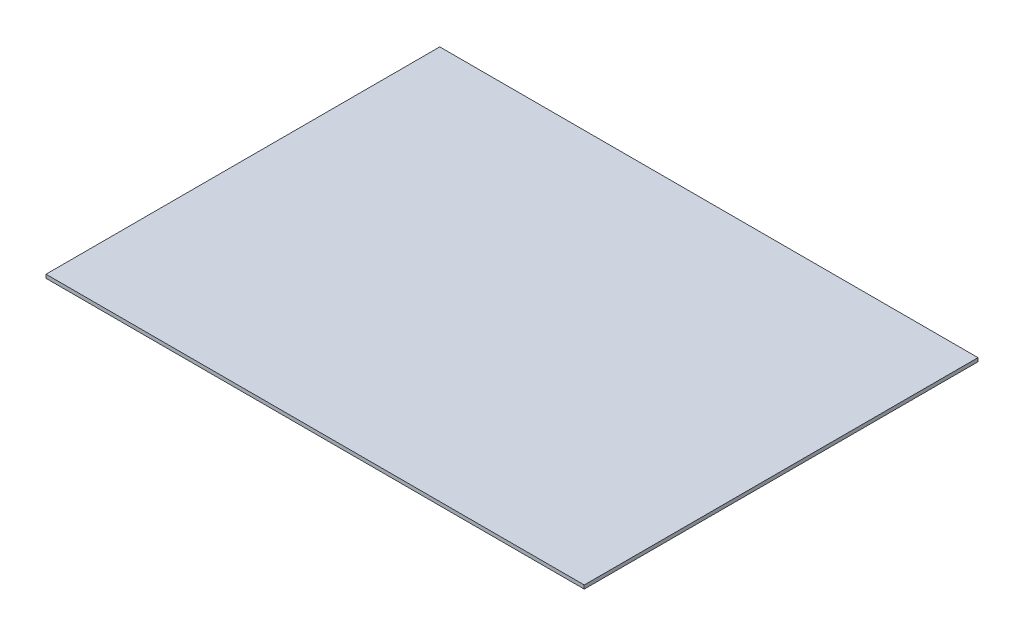
ISO-10303-21;
HEADER;
FILE_DESCRIPTION(('STEP AP214'),'2;1');
FILE_NAME('part.step','',(''),(''),'','','');
FILE_SCHEMA(('AUTOMOTIVE_DESIGN { 1 0 10303 214 1 1 1 1 }'));
ENDSEC;
DATA;
#1=APPLICATION_CONTEXT('core data for automotive mechanical design processes');
#2=APPLICATION_PROTOCOL_DEFINITION('international standard','automotive_design',2000,#1);
#3=PRODUCT_CONTEXT('',#1,'mechanical');
#4=PRODUCT('Part','Part','',(#3));
#5=PRODUCT_RELATED_PRODUCT_CATEGORY('part','',(#4));
#6=PRODUCT_DEFINITION_FORMATION('','',#4);
#7=PRODUCT_DEFINITION_CONTEXT('part definition',#1,'design');
#8=PRODUCT_DEFINITION('design','',#6,#7);
#9=PRODUCT_DEFINITION_SHAPE('','',#8);
#10=(LENGTH_UNIT() NAMED_UNIT(*) SI_UNIT(.MILLI.,.METRE.));
#11=(NAMED_UNIT(*) PLANE_ANGLE_UNIT() SI_UNIT($,.RADIAN.));
#12=(NAMED_UNIT(*) SI_UNIT($,.STERADIAN.) SOLID_ANGLE_UNIT());
#13=UNCERTAINTY_MEASURE_WITH_UNIT(LENGTH_MEASURE(1.E-05),#10,'distance_accuracy_value','');
#14=(GEOMETRIC_REPRESENTATION_CONTEXT(3) GLOBAL_UNCERTAINTY_ASSIGNED_CONTEXT((#13)) GLOBAL_UNIT_ASSIGNED_CONTEXT((#10,
#11,#12)) REPRESENTATION_CONTEXT('',''));
#15=CARTESIAN_POINT('',(0.,0.,0.));
#16=DIRECTION('',(0.,0.,1.));
#17=DIRECTION('',(1.,0.,0.));
#18=AXIS2_PLACEMENT_3D('',#15,#16,#17);
#19=CARTESIAN_POINT('',(298.,0.,-191.321685100182));
#20=DIRECTION('',(0.,0.,1.));
#21=DIRECTION('',(1.,0.,0.));
#22=AXIS2_PLACEMENT_3D('',#19,#20,#21);
#23=PLANE('',#22);
#24=DIRECTION('',(0.,1.,0.));
#25=VECTOR('',#24,1.);
#26=CARTESIAN_POINT('',(0.,0.,-191.321685100182));
#27=LINE('',#26,#25);
#28=CARTESIAN_POINT('',(0.,0.,-191.321685100182));
#29=VERTEX_POINT('',#28);
#30=CARTESIAN_POINT('',(0.,2.,-191.321685100182));
#31=VERTEX_POINT('',#30);
#32=EDGE_CURVE('E112',#29,#31,#27,.T.);
#33=ORIENTED_EDGE('',*,*,#32,.T.);
#34=DIRECTION('',(-1.,0.,0.));
#35=VECTOR('',#34,1.);
#36=CARTESIAN_POINT('',(298.,2.,-191.321685100182));
#37=LINE('',#36,#35);
#38=CARTESIAN_POINT('',(298.,2.,-191.321685100182));
#39=VERTEX_POINT('',#38);
#40=EDGE_CURVE('E11',#39,#31,#37,.T.);
#41=ORIENTED_EDGE('',*,*,#40,.F.);
#42=DIRECTION('',(0.,1.,0.));
#43=VECTOR('',#42,1.);
#44=CARTESIAN_POINT('',(298.,0.,-191.321685100182));
#45=LINE('',#44,#43);
#46=CARTESIAN_POINT('',(298.,0.,-191.321685100182));
#47=VERTEX_POINT('',#46);
#48=EDGE_CURVE('E93',#47,#39,#45,.T.);
#49=ORIENTED_EDGE('',*,*,#48,.F.);
#50=DIRECTION('',(-1.,0.,0.));
#51=VECTOR('',#50,1.);
#52=CARTESIAN_POINT('',(298.,0.,-191.321685100182));
#53=LINE('',#52,#51);
#54=EDGE_CURVE('E108',#47,#29,#53,.T.);
#55=ORIENTED_EDGE('',*,*,#54,.T.);
#56=EDGE_LOOP('',(#33,#41,#49,#55));
#57=FACE_BOUND('',#56,.T.);
#58=ADVANCED_FACE('F45',(#57),#23,.F.);
#59=CARTESIAN_POINT('',(298.,2.,-191.321685100182));
#60=DIRECTION('',(0.,-1.,0.));
#61=DIRECTION('',(0.,0.,-1.));
#62=AXIS2_PLACEMENT_3D('',#59,#60,#61);
#63=PLANE('',#62);
#64=DIRECTION('',(0.,0.,1.));
#65=VECTOR('',#64,1.);
#66=CARTESIAN_POINT('',(0.,2.,-191.321685100182));
#67=LINE('',#66,#65);
#68=CARTESIAN_POINT('',(0.,2.,26.6783148998178));
#69=VERTEX_POINT('',#68);
#70=EDGE_CURVE('E99',#31,#69,#67,.T.);
#71=ORIENTED_EDGE('',*,*,#70,.T.);
#72=DIRECTION('',(-1.,0.,0.));
#73=VECTOR('',#72,1.);
#74=CARTESIAN_POINT('',(298.,2.,26.6783148998178));
#75=LINE('',#74,#73);
#76=CARTESIAN_POINT('',(298.,2.,26.6783148998178));
#77=VERTEX_POINT('',#76);
#78=EDGE_CURVE('E54',#77,#69,#75,.T.);
#79=ORIENTED_EDGE('',*,*,#78,.F.);
#80=DIRECTION('',(0.,0.,1.));
#81=VECTOR('',#80,1.);
#82=CARTESIAN_POINT('',(298.,2.,-191.321685100182));
#83=LINE('',#82,#81);
#84=EDGE_CURVE('E88',#39,#77,#83,.T.);
#85=ORIENTED_EDGE('',*,*,#84,.F.);
#86=ORIENTED_EDGE('',*,*,#40,.T.);
#87=EDGE_LOOP('',(#71,#79,#85,#86));
#88=FACE_BOUND('',#87,.T.);
#89=ADVANCED_FACE('F98',(#88),#63,.F.);
#90=CARTESIAN_POINT('',(298.,0.,26.6783148998178));
#91=DIRECTION('',(0.,0.,1.));
#92=DIRECTION('',(1.,0.,0.));
#93=AXIS2_PLACEMENT_3D('',#90,#91,#92);
#94=PLANE('',#93);
#95=DIRECTION('',(0.,1.,0.));
#96=VECTOR('',#95,1.);
#97=CARTESIAN_POINT('',(0.,0.,26.6783148998178));
#98=LINE('',#97,#96);
#99=CARTESIAN_POINT('',(0.,0.,26.6783148998178));
#100=VERTEX_POINT('',#99);
#101=EDGE_CURVE('E118',#100,#69,#98,.T.);
#102=ORIENTED_EDGE('',*,*,#101,.F.);
#103=DIRECTION('',(-1.,0.,0.));
#104=VECTOR('',#103,1.);
#105=CARTESIAN_POINT('',(298.,0.,26.6783148998178));
#106=LINE('',#105,#104);
#107=CARTESIAN_POINT('',(298.,0.,26.6783148998178));
#108=VERTEX_POINT('',#107);
#109=EDGE_CURVE('E78',#108,#100,#106,.T.);
#110=ORIENTED_EDGE('',*,*,#109,.F.);
#111=DIRECTION('',(0.,1.,0.));
#112=VECTOR('',#111,1.);
#113=CARTESIAN_POINT('',(298.,0.,26.6783148998178));
#114=LINE('',#113,#112);
#115=EDGE_CURVE('E91',#108,#77,#114,.T.);
#116=ORIENTED_EDGE('',*,*,#115,.T.);
#117=ORIENTED_EDGE('',*,*,#78,.T.);
#118=EDGE_LOOP('',(#102,#110,#116,#117));
#119=FACE_BOUND('',#118,.T.);
#120=ADVANCED_FACE('F104',(#119),#94,.T.);
#121=CARTESIAN_POINT('',(298.,0.,26.6783148998178));
#122=DIRECTION('',(0.,1.,0.));
#123=DIRECTION('',(0.,0.,1.));
#124=AXIS2_PLACEMENT_3D('',#121,#122,#123);
#125=PLANE('',#124);
#126=DIRECTION('',(0.,0.,-1.));
#127=VECTOR('',#126,1.);
#128=CARTESIAN_POINT('',(0.,0.,26.6783148998178));
#129=LINE('',#128,#127);
#130=EDGE_CURVE('E81',#100,#29,#129,.T.);
#131=ORIENTED_EDGE('',*,*,#130,.T.);
#132=ORIENTED_EDGE('',*,*,#54,.F.);
#133=DIRECTION('',(0.,0.,-1.));
#134=VECTOR('',#133,1.);
#135=CARTESIAN_POINT('',(298.,0.,26.6783148998178));
#136=LINE('',#135,#134);
#137=EDGE_CURVE('E62',#108,#47,#136,.T.);
#138=ORIENTED_EDGE('',*,*,#137,.F.);
#139=ORIENTED_EDGE('',*,*,#109,.T.);
#140=EDGE_LOOP('',(#131,#132,#138,#139));
#141=FACE_BOUND('',#140,.T.);
#142=ADVANCED_FACE('F135',(#141),#125,.F.);
#143=CARTESIAN_POINT('',(298.,0.,0.));
#144=DIRECTION('',(1.,0.,0.));
#145=DIRECTION('',(0.,0.,-1.));
#146=AXIS2_PLACEMENT_3D('',#143,#144,#145);
#147=PLANE('',#146);
#148=ORIENTED_EDGE('',*,*,#48,.T.);
#149=ORIENTED_EDGE('',*,*,#84,.T.);
#150=ORIENTED_EDGE('',*,*,#115,.F.);
#151=ORIENTED_EDGE('',*,*,#137,.T.);
#152=EDGE_LOOP('',(#148,#149,#150,#151));
#153=FACE_BOUND('',#152,.T.);
#154=ADVANCED_FACE('F89',(#153),#147,.T.);
#155=CARTESIAN_POINT('',(0.,0.,0.));
#156=DIRECTION('',(1.,0.,0.));
#157=DIRECTION('',(0.,0.,-1.));
#158=AXIS2_PLACEMENT_3D('',#155,#156,#157);
#159=PLANE('',#158);
#160=ORIENTED_EDGE('',*,*,#32,.F.);
#161=ORIENTED_EDGE('',*,*,#130,.F.);
#162=ORIENTED_EDGE('',*,*,#101,.T.);
#163=ORIENTED_EDGE('',*,*,#70,.F.);
#164=EDGE_LOOP('',(#160,#161,#162,#163));
#165=FACE_BOUND('',#164,.T.);
#166=ADVANCED_FACE('F129',(#165),#159,.F.);
#167=CLOSED_SHELL('',(#58,#89,#120,#142,#154,#166));
#168=MANIFOLD_SOLID_BREP('B2',#167);
#169=ADVANCED_BREP_SHAPE_REPRESENTATION('',(#18,#168),#14);
#170=SHAPE_DEFINITION_REPRESENTATION(#9,#169);
ENDSEC;
END-ISO-10303-21;
